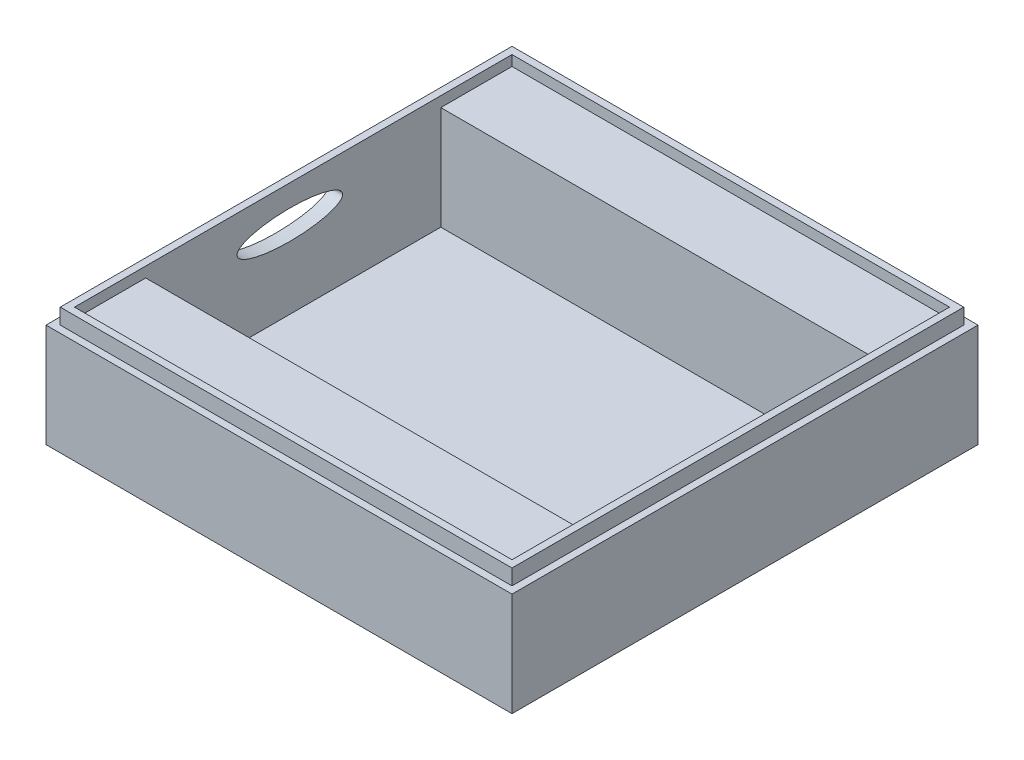
ISO-10303-21;
HEADER;
FILE_DESCRIPTION(('STEP AP214'),'2;1');
FILE_NAME('part.step','',(''),(''),'','','');
FILE_SCHEMA(('AUTOMOTIVE_DESIGN { 1 0 10303 214 1 1 1 1 }'));
ENDSEC;
DATA;
#1=APPLICATION_CONTEXT('core data for automotive mechanical design processes');
#2=APPLICATION_PROTOCOL_DEFINITION('international standard','automotive_design',2000,#1);
#3=PRODUCT_CONTEXT('',#1,'mechanical');
#4=PRODUCT('Part','Part','',(#3));
#5=PRODUCT_RELATED_PRODUCT_CATEGORY('part','',(#4));
#6=PRODUCT_DEFINITION_FORMATION('','',#4);
#7=PRODUCT_DEFINITION_CONTEXT('part definition',#1,'design');
#8=PRODUCT_DEFINITION('design','',#6,#7);
#9=PRODUCT_DEFINITION_SHAPE('','',#8);
#10=(LENGTH_UNIT() NAMED_UNIT(*) SI_UNIT(.MILLI.,.METRE.));
#11=(NAMED_UNIT(*) PLANE_ANGLE_UNIT() SI_UNIT($,.RADIAN.));
#12=(NAMED_UNIT(*) SI_UNIT($,.STERADIAN.) SOLID_ANGLE_UNIT());
#13=UNCERTAINTY_MEASURE_WITH_UNIT(LENGTH_MEASURE(1.E-05),#10,'distance_accuracy_value','');
#14=(GEOMETRIC_REPRESENTATION_CONTEXT(3) GLOBAL_UNCERTAINTY_ASSIGNED_CONTEXT((#13)) GLOBAL_UNIT_ASSIGNED_CONTEXT((#10,
#11,#12)) REPRESENTATION_CONTEXT('',''));
#15=CARTESIAN_POINT('',(0.,0.,0.));
#16=DIRECTION('',(0.,0.,1.));
#17=DIRECTION('',(1.,0.,0.));
#18=AXIS2_PLACEMENT_3D('',#15,#16,#17);
#19=CARTESIAN_POINT('',(0.,20.,0.));
#20=DIRECTION('',(0.,1.,0.));
#21=DIRECTION('',(0.,0.,1.));
#22=AXIS2_PLACEMENT_3D('',#19,#20,#21);
#23=PLANE('',#22);
#24=DIRECTION('',(0.,0.,1.));
#25=VECTOR('',#24,1.);
#26=CARTESIAN_POINT('',(-45.,20.,45.));
#27=LINE('',#26,#25);
#28=CARTESIAN_POINT('',(-45.,20.,-45.));
#29=VERTEX_POINT('',#28);
#30=CARTESIAN_POINT('',(-45.,20.,45.));
#31=VERTEX_POINT('',#30);
#32=EDGE_CURVE('E352',#29,#31,#27,.T.);
#33=ORIENTED_EDGE('',*,*,#32,.T.);
#34=DIRECTION('',(1.,0.,0.));
#35=VECTOR('',#34,1.);
#36=CARTESIAN_POINT('',(45.,20.,45.));
#37=LINE('',#36,#35);
#38=CARTESIAN_POINT('',(45.,20.,45.));
#39=VERTEX_POINT('',#38);
#40=EDGE_CURVE('E98',#31,#39,#37,.T.);
#41=ORIENTED_EDGE('',*,*,#40,.T.);
#42=DIRECTION('',(0.,0.,-1.));
#43=VECTOR('',#42,1.);
#44=CARTESIAN_POINT('',(45.,20.,45.));
#45=LINE('',#44,#43);
#46=CARTESIAN_POINT('',(45.,20.,-45.));
#47=VERTEX_POINT('',#46);
#48=EDGE_CURVE('E346',#39,#47,#45,.T.);
#49=ORIENTED_EDGE('',*,*,#48,.T.);
#50=DIRECTION('',(-1.,0.,0.));
#51=VECTOR('',#50,1.);
#52=CARTESIAN_POINT('',(45.,20.,-45.));
#53=LINE('',#52,#51);
#54=EDGE_CURVE('E70',#47,#29,#53,.T.);
#55=ORIENTED_EDGE('',*,*,#54,.T.);
#56=EDGE_LOOP('',(#33,#41,#49,#55));
#57=FACE_BOUND('',#56,.T.);
#58=DIRECTION('',(1.,0.,0.));
#59=VECTOR('',#58,1.);
#60=CARTESIAN_POINT('',(-43.625,20.,43.625));
#61=LINE('',#60,#59);
#62=CARTESIAN_POINT('',(-43.625,20.,43.625));
#63=VERTEX_POINT('',#62);
#64=CARTESIAN_POINT('',(43.625,20.,43.625));
#65=VERTEX_POINT('',#64);
#66=EDGE_CURVE('E232',#63,#65,#61,.T.);
#67=ORIENTED_EDGE('',*,*,#66,.F.);
#68=DIRECTION('',(0.,0.,1.));
#69=VECTOR('',#68,1.);
#70=CARTESIAN_POINT('',(-43.625,20.,-43.625));
#71=LINE('',#70,#69);
#72=CARTESIAN_POINT('',(-43.625,20.,-43.625));
#73=VERTEX_POINT('',#72);
#74=EDGE_CURVE('E191',#73,#63,#71,.T.);
#75=ORIENTED_EDGE('',*,*,#74,.F.);
#76=DIRECTION('',(-1.,0.,0.));
#77=VECTOR('',#76,1.);
#78=CARTESIAN_POINT('',(-43.625,20.,-43.625));
#79=LINE('',#78,#77);
#80=CARTESIAN_POINT('',(43.625,20.,-43.625));
#81=VERTEX_POINT('',#80);
#82=EDGE_CURVE('E219',#81,#73,#79,.T.);
#83=ORIENTED_EDGE('',*,*,#82,.F.);
#84=DIRECTION('',(0.,0.,-1.));
#85=VECTOR('',#84,1.);
#86=CARTESIAN_POINT('',(43.625,20.,-43.625));
#87=LINE('',#86,#85);
#88=EDGE_CURVE('E235',#65,#81,#87,.T.);
#89=ORIENTED_EDGE('',*,*,#88,.F.);
#90=EDGE_LOOP('',(#67,#75,#83,#89));
#91=FACE_BOUND('',#90,.T.);
#92=ADVANCED_FACE('F45',(#57,#91),#23,.T.);
#93=CARTESIAN_POINT('',(42.25,7.,42.25));
#94=DIRECTION('',(1.,0.,0.));
#95=DIRECTION('',(0.,0.,-1.));
#96=AXIS2_PLACEMENT_3D('',#93,#94,#95);
#97=PLANE('',#96);
#98=DIRECTION('',(0.,1.,0.));
#99=VECTOR('',#98,1.);
#100=CARTESIAN_POINT('',(42.25,1.,28.5));
#101=LINE('',#100,#99);
#102=CARTESIAN_POINT('',(42.25,1.,28.5));
#103=VERTEX_POINT('',#102);
#104=CARTESIAN_POINT('',(42.25,21.,28.5));
#105=VERTEX_POINT('',#104);
#106=EDGE_CURVE('E367',#103,#105,#101,.T.);
#107=ORIENTED_EDGE('',*,*,#106,.T.);
#108=DIRECTION('',(0.,0.,-1.));
#109=VECTOR('',#108,1.);
#110=CARTESIAN_POINT('',(42.25,21.,42.25));
#111=LINE('',#110,#109);
#112=CARTESIAN_POINT('',(42.25,21.,42.25));
#113=VERTEX_POINT('',#112);
#114=EDGE_CURVE('E261',#113,#105,#111,.T.);
#115=ORIENTED_EDGE('',*,*,#114,.F.);
#116=DIRECTION('',(0.,-1.,0.));
#117=VECTOR('',#116,1.);
#118=CARTESIAN_POINT('',(42.25,23.,42.25));
#119=LINE('',#118,#117);
#120=CARTESIAN_POINT('',(42.25,23.,42.25));
#121=VERTEX_POINT('',#120);
#122=EDGE_CURVE('E192',#121,#113,#119,.T.);
#123=ORIENTED_EDGE('',*,*,#122,.F.);
#124=DIRECTION('',(0.,0.,-1.));
#125=VECTOR('',#124,1.);
#126=CARTESIAN_POINT('',(42.25,23.,-42.25));
#127=LINE('',#126,#125);
#128=CARTESIAN_POINT('',(42.25,23.,-42.25));
#129=VERTEX_POINT('',#128);
#130=EDGE_CURVE('E197',#121,#129,#127,.T.);
#131=ORIENTED_EDGE('',*,*,#130,.T.);
#132=DIRECTION('',(0.,-1.,0.));
#133=VECTOR('',#132,1.);
#134=CARTESIAN_POINT('',(42.25,23.,-42.25));
#135=LINE('',#134,#133);
#136=CARTESIAN_POINT('',(42.25,21.,-42.25));
#137=VERTEX_POINT('',#136);
#138=EDGE_CURVE('E208',#129,#137,#135,.T.);
#139=ORIENTED_EDGE('',*,*,#138,.T.);
#140=DIRECTION('',(0.,0.,-1.));
#141=VECTOR('',#140,1.);
#142=CARTESIAN_POINT('',(42.25,21.,-42.25));
#143=LINE('',#142,#141);
#144=CARTESIAN_POINT('',(42.25,21.,-28.5));
#145=VERTEX_POINT('',#144);
#146=EDGE_CURVE('E273',#145,#137,#143,.T.);
#147=ORIENTED_EDGE('',*,*,#146,.F.);
#148=DIRECTION('',(0.,1.,0.));
#149=VECTOR('',#148,1.);
#150=CARTESIAN_POINT('',(42.25,1.,-28.5));
#151=LINE('',#150,#149);
#152=CARTESIAN_POINT('',(42.25,1.,-28.5));
#153=VERTEX_POINT('',#152);
#154=EDGE_CURVE('E383',#153,#145,#151,.T.);
#155=ORIENTED_EDGE('',*,*,#154,.F.);
#156=DIRECTION('',(0.,0.,-1.));
#157=VECTOR('',#156,1.);
#158=CARTESIAN_POINT('',(42.25,1.,28.5));
#159=LINE('',#158,#157);
#160=EDGE_CURVE('E287',#103,#153,#159,.T.);
#161=ORIENTED_EDGE('',*,*,#160,.F.);
#162=EDGE_LOOP('',(#107,#115,#123,#131,#139,#147,#155,#161));
#163=FACE_BOUND('',#162,.T.);
#164=ADVANCED_FACE('F312',(#163),#97,.F.);
#165=CARTESIAN_POINT('',(-42.25,7.,42.25));
#166=DIRECTION('',(-1.,0.,0.));
#167=DIRECTION('',(0.,0.,1.));
#168=AXIS2_PLACEMENT_3D('',#165,#166,#167);
#169=PLANE('',#168);
#170=CARTESIAN_POINT('',(-42.25,15.9834994570971,0.657720021009747));
#171=DIRECTION('',(-1.,0.,0.));
#172=DIRECTION('',(0.,0.,-1.));
#173=AXIS2_PLACEMENT_3D('',#170,#171,#172);
#174=ELLIPSE('',#173,10.196247105593,2.79357288826837);
#175=CARTESIAN_POINT('',(-42.25,15.9834994570971,-9.53852708458323));
#176=VERTEX_POINT('',#175);
#177=EDGE_CURVE('E282',#176,#176,#174,.T.);
#178=ORIENTED_EDGE('',*,*,#177,.T.);
#179=EDGE_LOOP('',(#178));
#180=FACE_BOUND('',#179,.T.);
#181=DIRECTION('',(0.,1.,0.));
#182=VECTOR('',#181,1.);
#183=CARTESIAN_POINT('',(-42.25,1.,-28.5));
#184=LINE('',#183,#182);
#185=CARTESIAN_POINT('',(-42.25,1.,-28.5));
#186=VERTEX_POINT('',#185);
#187=CARTESIAN_POINT('',(-42.25,21.,-28.5));
#188=VERTEX_POINT('',#187);
#189=EDGE_CURVE('E375',#186,#188,#184,.T.);
#190=ORIENTED_EDGE('',*,*,#189,.T.);
#191=DIRECTION('',(0.,0.,1.));
#192=VECTOR('',#191,1.);
#193=CARTESIAN_POINT('',(-42.25,21.,-42.25));
#194=LINE('',#193,#192);
#195=CARTESIAN_POINT('',(-42.25,21.,-42.25));
#196=VERTEX_POINT('',#195);
#197=EDGE_CURVE('E265',#196,#188,#194,.T.);
#198=ORIENTED_EDGE('',*,*,#197,.F.);
#199=DIRECTION('',(0.,-1.,0.));
#200=VECTOR('',#199,1.);
#201=CARTESIAN_POINT('',(-42.25,23.,-42.25));
#202=LINE('',#201,#200);
#203=CARTESIAN_POINT('',(-42.25,23.,-42.25));
#204=VERTEX_POINT('',#203);
#205=EDGE_CURVE('E177',#204,#196,#202,.T.);
#206=ORIENTED_EDGE('',*,*,#205,.F.);
#207=DIRECTION('',(0.,0.,1.));
#208=VECTOR('',#207,1.);
#209=CARTESIAN_POINT('',(-42.25,23.,-42.25));
#210=LINE('',#209,#208);
#211=CARTESIAN_POINT('',(-42.25,23.,42.25));
#212=VERTEX_POINT('',#211);
#213=EDGE_CURVE('E170',#204,#212,#210,.T.);
#214=ORIENTED_EDGE('',*,*,#213,.T.);
#215=DIRECTION('',(0.,-1.,0.));
#216=VECTOR('',#215,1.);
#217=CARTESIAN_POINT('',(-42.25,23.,42.25));
#218=LINE('',#217,#216);
#219=CARTESIAN_POINT('',(-42.25,21.,42.25));
#220=VERTEX_POINT('',#219);
#221=EDGE_CURVE('E174',#212,#220,#218,.T.);
#222=ORIENTED_EDGE('',*,*,#221,.T.);
#223=DIRECTION('',(0.,0.,1.));
#224=VECTOR('',#223,1.);
#225=CARTESIAN_POINT('',(-42.25,21.,42.25));
#226=LINE('',#225,#224);
#227=CARTESIAN_POINT('',(-42.25,21.,28.5));
#228=VERTEX_POINT('',#227);
#229=EDGE_CURVE('E254',#228,#220,#226,.T.);
#230=ORIENTED_EDGE('',*,*,#229,.F.);
#231=DIRECTION('',(0.,1.,0.));
#232=VECTOR('',#231,1.);
#233=CARTESIAN_POINT('',(-42.25,1.,28.5));
#234=LINE('',#233,#232);
#235=CARTESIAN_POINT('',(-42.25,1.,28.5));
#236=VERTEX_POINT('',#235);
#237=EDGE_CURVE('E370',#236,#228,#234,.T.);
#238=ORIENTED_EDGE('',*,*,#237,.F.);
#239=DIRECTION('',(0.,0.,1.));
#240=VECTOR('',#239,1.);
#241=CARTESIAN_POINT('',(-42.25,1.,28.5));
#242=LINE('',#241,#240);
#243=EDGE_CURVE('E439',#186,#236,#242,.T.);
#244=ORIENTED_EDGE('',*,*,#243,.F.);
#245=EDGE_LOOP('',(#190,#198,#206,#214,#222,#230,#238,#244));
#246=FACE_BOUND('',#245,.T.);
#247=ADVANCED_FACE('F172',(#180,#246),#169,.F.);
#248=CARTESIAN_POINT('',(-45.,20.,45.));
#249=DIRECTION('',(1.,0.,0.));
#250=DIRECTION('',(0.,0.,-1.));
#251=AXIS2_PLACEMENT_3D('',#248,#249,#250);
#252=PLANE('',#251);
#253=CARTESIAN_POINT('',(-45.,15.9834994570971,0.657720021009747));
#254=DIRECTION('',(-1.,0.,0.));
#255=DIRECTION('',(0.,0.,-1.));
#256=AXIS2_PLACEMENT_3D('',#253,#254,#255);
#257=ELLIPSE('',#256,10.196247105593,2.79357288826837);
#258=CARTESIAN_POINT('',(-45.,15.9834994570971,-9.53852708458323));
#259=VERTEX_POINT('',#258);
#260=EDGE_CURVE('E281',#259,#259,#257,.T.);
#261=ORIENTED_EDGE('',*,*,#260,.F.);
#262=EDGE_LOOP('',(#261));
#263=FACE_BOUND('',#262,.T.);
#264=DIRECTION('',(0.,0.,1.));
#265=VECTOR('',#264,1.);
#266=CARTESIAN_POINT('',(-45.,0.,45.));
#267=LINE('',#266,#265);
#268=CARTESIAN_POINT('',(-45.,0.,-45.));
#269=VERTEX_POINT('',#268);
#270=CARTESIAN_POINT('',(-45.,0.,45.));
#271=VERTEX_POINT('',#270);
#272=EDGE_CURVE('E343',#269,#271,#267,.T.);
#273=ORIENTED_EDGE('',*,*,#272,.T.);
#274=DIRECTION('',(0.,-1.,0.));
#275=VECTOR('',#274,1.);
#276=CARTESIAN_POINT('',(-45.,20.,45.));
#277=LINE('',#276,#275);
#278=EDGE_CURVE('E11',#31,#271,#277,.T.);
#279=ORIENTED_EDGE('',*,*,#278,.F.);
#280=ORIENTED_EDGE('',*,*,#32,.F.);
#281=DIRECTION('',(0.,-1.,0.));
#282=VECTOR('',#281,1.);
#283=CARTESIAN_POINT('',(-45.,20.,-45.));
#284=LINE('',#283,#282);
#285=EDGE_CURVE('E356',#29,#269,#284,.T.);
#286=ORIENTED_EDGE('',*,*,#285,.T.);
#287=EDGE_LOOP('',(#273,#279,#280,#286));
#288=FACE_BOUND('',#287,.T.);
#289=ADVANCED_FACE('F47',(#263,#288),#252,.F.);
#290=CARTESIAN_POINT('',(45.,20.,45.));
#291=DIRECTION('',(0.,0.,-1.));
#292=DIRECTION('',(-1.,0.,0.));
#293=AXIS2_PLACEMENT_3D('',#290,#291,#292);
#294=PLANE('',#293);
#295=DIRECTION('',(1.,0.,0.));
#296=VECTOR('',#295,1.);
#297=CARTESIAN_POINT('',(45.,0.,45.));
#298=LINE('',#297,#296);
#299=CARTESIAN_POINT('',(45.,0.,45.));
#300=VERTEX_POINT('',#299);
#301=EDGE_CURVE('E334',#271,#300,#298,.T.);
#302=ORIENTED_EDGE('',*,*,#301,.T.);
#303=DIRECTION('',(0.,-1.,0.));
#304=VECTOR('',#303,1.);
#305=CARTESIAN_POINT('',(45.,20.,45.));
#306=LINE('',#305,#304);
#307=EDGE_CURVE('E54',#39,#300,#306,.T.);
#308=ORIENTED_EDGE('',*,*,#307,.F.);
#309=ORIENTED_EDGE('',*,*,#40,.F.);
#310=ORIENTED_EDGE('',*,*,#278,.T.);
#311=EDGE_LOOP('',(#302,#308,#309,#310));
#312=FACE_BOUND('',#311,.T.);
#313=ADVANCED_FACE('F327',(#312),#294,.F.);
#314=CARTESIAN_POINT('',(45.,20.,45.));
#315=DIRECTION('',(-1.,0.,0.));
#316=DIRECTION('',(0.,0.,1.));
#317=AXIS2_PLACEMENT_3D('',#314,#315,#316);
#318=PLANE('',#317);
#319=DIRECTION('',(0.,0.,-1.));
#320=VECTOR('',#319,1.);
#321=CARTESIAN_POINT('',(45.,0.,45.));
#322=LINE('',#321,#320);
#323=CARTESIAN_POINT('',(45.,0.,-45.));
#324=VERTEX_POINT('',#323);
#325=EDGE_CURVE('E342',#300,#324,#322,.T.);
#326=ORIENTED_EDGE('',*,*,#325,.T.);
#327=DIRECTION('',(0.,-1.,0.));
#328=VECTOR('',#327,1.);
#329=CARTESIAN_POINT('',(45.,20.,-45.));
#330=LINE('',#329,#328);
#331=EDGE_CURVE('E348',#47,#324,#330,.T.);
#332=ORIENTED_EDGE('',*,*,#331,.F.);
#333=ORIENTED_EDGE('',*,*,#48,.F.);
#334=ORIENTED_EDGE('',*,*,#307,.T.);
#335=EDGE_LOOP('',(#326,#332,#333,#334));
#336=FACE_BOUND('',#335,.T.);
#337=ADVANCED_FACE('F325',(#336),#318,.F.);
#338=CARTESIAN_POINT('',(45.,20.,-45.));
#339=DIRECTION('',(0.,0.,1.));
#340=DIRECTION('',(1.,0.,0.));
#341=AXIS2_PLACEMENT_3D('',#338,#339,#340);
#342=PLANE('',#341);
#343=DIRECTION('',(-1.,0.,0.));
#344=VECTOR('',#343,1.);
#345=CARTESIAN_POINT('',(45.,0.,-45.));
#346=LINE('',#345,#344);
#347=EDGE_CURVE('E91',#324,#269,#346,.T.);
#348=ORIENTED_EDGE('',*,*,#347,.T.);
#349=ORIENTED_EDGE('',*,*,#285,.F.);
#350=ORIENTED_EDGE('',*,*,#54,.F.);
#351=ORIENTED_EDGE('',*,*,#331,.T.);
#352=EDGE_LOOP('',(#348,#349,#350,#351));
#353=FACE_BOUND('',#352,.T.);
#354=ADVANCED_FACE('F321',(#353),#342,.F.);
#355=CARTESIAN_POINT('',(0.,0.,0.));
#356=DIRECTION('',(0.,1.,0.));
#357=DIRECTION('',(0.,0.,1.));
#358=AXIS2_PLACEMENT_3D('',#355,#356,#357);
#359=PLANE('',#358);
#360=ORIENTED_EDGE('',*,*,#272,.F.);
#361=ORIENTED_EDGE('',*,*,#347,.F.);
#362=ORIENTED_EDGE('',*,*,#325,.F.);
#363=ORIENTED_EDGE('',*,*,#301,.F.);
#364=EDGE_LOOP('',(#360,#361,#362,#363));
#365=FACE_BOUND('',#364,.T.);
#366=ADVANCED_FACE('F305',(#365),#359,.F.);
#367=CARTESIAN_POINT('',(-42.25,1.,28.5));
#368=DIRECTION('',(0.,0.,1.));
#369=DIRECTION('',(1.,0.,0.));
#370=AXIS2_PLACEMENT_3D('',#367,#368,#369);
#371=PLANE('',#370);
#372=ORIENTED_EDGE('',*,*,#237,.T.);
#373=DIRECTION('',(-1.,0.,0.));
#374=VECTOR('',#373,1.);
#375=CARTESIAN_POINT('',(42.25,21.,28.5));
#376=LINE('',#375,#374);
#377=EDGE_CURVE('E257',#105,#228,#376,.T.);
#378=ORIENTED_EDGE('',*,*,#377,.F.);
#379=ORIENTED_EDGE('',*,*,#106,.F.);
#380=DIRECTION('',(1.,0.,0.));
#381=VECTOR('',#380,1.);
#382=CARTESIAN_POINT('',(-42.25,1.,28.5));
#383=LINE('',#382,#381);
#384=EDGE_CURVE('E378',#236,#103,#383,.T.);
#385=ORIENTED_EDGE('',*,*,#384,.F.);
#386=EDGE_LOOP('',(#372,#378,#379,#385));
#387=FACE_BOUND('',#386,.T.);
#388=ADVANCED_FACE('F302',(#387),#371,.F.);
#389=CARTESIAN_POINT('',(-42.25,1.,-28.5));
#390=DIRECTION('',(0.,0.,-1.));
#391=DIRECTION('',(-1.,0.,0.));
#392=AXIS2_PLACEMENT_3D('',#389,#390,#391);
#393=PLANE('',#392);
#394=ORIENTED_EDGE('',*,*,#154,.T.);
#395=DIRECTION('',(1.,0.,0.));
#396=VECTOR('',#395,1.);
#397=CARTESIAN_POINT('',(-42.25,21.,-28.5));
#398=LINE('',#397,#396);
#399=EDGE_CURVE('E269',#188,#145,#398,.T.);
#400=ORIENTED_EDGE('',*,*,#399,.F.);
#401=ORIENTED_EDGE('',*,*,#189,.F.);
#402=DIRECTION('',(-1.,0.,0.));
#403=VECTOR('',#402,1.);
#404=CARTESIAN_POINT('',(-42.25,1.,-28.5));
#405=LINE('',#404,#403);
#406=EDGE_CURVE('E435',#153,#186,#405,.T.);
#407=ORIENTED_EDGE('',*,*,#406,.F.);
#408=EDGE_LOOP('',(#394,#400,#401,#407));
#409=FACE_BOUND('',#408,.T.);
#410=ADVANCED_FACE('F300',(#409),#393,.F.);
#411=CARTESIAN_POINT('',(0.,1.,0.));
#412=DIRECTION('',(0.,-1.,0.));
#413=DIRECTION('',(0.,0.,-1.));
#414=AXIS2_PLACEMENT_3D('',#411,#412,#413);
#415=PLANE('',#414);
#416=ORIENTED_EDGE('',*,*,#160,.T.);
#417=ORIENTED_EDGE('',*,*,#406,.T.);
#418=ORIENTED_EDGE('',*,*,#243,.T.);
#419=ORIENTED_EDGE('',*,*,#384,.T.);
#420=EDGE_LOOP('',(#416,#417,#418,#419));
#421=FACE_BOUND('',#420,.T.);
#422=ADVANCED_FACE('F295',(#421),#415,.F.);
#423=DIRECTION('',(-1.,0.,0.));
#424=VECTOR('',#423,1.);
#425=SURFACE_OF_LINEAR_EXTRUSION('',#174,#424);
#426=ORIENTED_EDGE('',*,*,#177,.F.);
#427=EDGE_LOOP('',(#426));
#428=FACE_BOUND('',#427,.T.);
#429=ORIENTED_EDGE('',*,*,#260,.T.);
#430=EDGE_LOOP('',(#429));
#431=FACE_BOUND('',#430,.T.);
#432=ADVANCED_FACE('F290',(#428,#431),#425,.F.);
#433=CARTESIAN_POINT('',(0.,21.,0.));
#434=DIRECTION('',(0.,1.,0.));
#435=DIRECTION('',(0.,0.,1.));
#436=AXIS2_PLACEMENT_3D('',#433,#434,#435);
#437=PLANE('',#436);
#438=ORIENTED_EDGE('',*,*,#197,.T.);
#439=ORIENTED_EDGE('',*,*,#399,.T.);
#440=ORIENTED_EDGE('',*,*,#146,.T.);
#441=DIRECTION('',(-1.,0.,0.));
#442=VECTOR('',#441,1.);
#443=CARTESIAN_POINT('',(-42.25,21.,-42.25));
#444=LINE('',#443,#442);
#445=EDGE_CURVE('E277',#137,#196,#444,.T.);
#446=ORIENTED_EDGE('',*,*,#445,.T.);
#447=EDGE_LOOP('',(#438,#439,#440,#446));
#448=FACE_BOUND('',#447,.T.);
#449=ADVANCED_FACE('F294',(#448),#437,.T.);
#450=CARTESIAN_POINT('',(0.,21.,0.));
#451=DIRECTION('',(0.,1.,0.));
#452=DIRECTION('',(0.,0.,1.));
#453=AXIS2_PLACEMENT_3D('',#450,#451,#452);
#454=PLANE('',#453);
#455=ORIENTED_EDGE('',*,*,#114,.T.);
#456=ORIENTED_EDGE('',*,*,#377,.T.);
#457=ORIENTED_EDGE('',*,*,#229,.T.);
#458=DIRECTION('',(1.,0.,0.));
#459=VECTOR('',#458,1.);
#460=CARTESIAN_POINT('',(42.25,21.,42.25));
#461=LINE('',#460,#459);
#462=EDGE_CURVE('E189',#220,#113,#461,.T.);
#463=ORIENTED_EDGE('',*,*,#462,.T.);
#464=EDGE_LOOP('',(#455,#456,#457,#463));
#465=FACE_BOUND('',#464,.T.);
#466=ADVANCED_FACE('F420',(#465),#454,.T.);
#467=CARTESIAN_POINT('',(0.,23.,0.));
#468=DIRECTION('',(0.,1.,0.));
#469=DIRECTION('',(0.,0.,1.));
#470=AXIS2_PLACEMENT_3D('',#467,#468,#469);
#471=PLANE('',#470);
#472=DIRECTION('',(0.,0.,1.));
#473=VECTOR('',#472,1.);
#474=CARTESIAN_POINT('',(-43.625,23.,-43.625));
#475=LINE('',#474,#473);
#476=CARTESIAN_POINT('',(-43.625,23.,-43.625));
#477=VERTEX_POINT('',#476);
#478=CARTESIAN_POINT('',(-43.625,23.,43.625));
#479=VERTEX_POINT('',#478);
#480=EDGE_CURVE('E214',#477,#479,#475,.T.);
#481=ORIENTED_EDGE('',*,*,#480,.T.);
#482=DIRECTION('',(1.,0.,0.));
#483=VECTOR('',#482,1.);
#484=CARTESIAN_POINT('',(-43.625,23.,43.625));
#485=LINE('',#484,#483);
#486=CARTESIAN_POINT('',(43.625,23.,43.625));
#487=VERTEX_POINT('',#486);
#488=EDGE_CURVE('E218',#479,#487,#485,.T.);
#489=ORIENTED_EDGE('',*,*,#488,.T.);
#490=DIRECTION('',(0.,0.,-1.));
#491=VECTOR('',#490,1.);
#492=CARTESIAN_POINT('',(43.625,23.,-43.625));
#493=LINE('',#492,#491);
#494=CARTESIAN_POINT('',(43.625,23.,-43.625));
#495=VERTEX_POINT('',#494);
#496=EDGE_CURVE('E222',#487,#495,#493,.T.);
#497=ORIENTED_EDGE('',*,*,#496,.T.);
#498=DIRECTION('',(-1.,0.,0.));
#499=VECTOR('',#498,1.);
#500=CARTESIAN_POINT('',(-43.625,23.,-43.625));
#501=LINE('',#500,#499);
#502=EDGE_CURVE('E225',#495,#477,#501,.T.);
#503=ORIENTED_EDGE('',*,*,#502,.T.);
#504=EDGE_LOOP('',(#481,#489,#497,#503));
#505=FACE_BOUND('',#504,.T.);
#506=DIRECTION('',(1.,0.,0.));
#507=VECTOR('',#506,1.);
#508=CARTESIAN_POINT('',(-42.25,23.,42.25));
#509=LINE('',#508,#507);
#510=EDGE_CURVE('E182',#212,#121,#509,.T.);
#511=ORIENTED_EDGE('',*,*,#510,.F.);
#512=ORIENTED_EDGE('',*,*,#213,.F.);
#513=DIRECTION('',(-1.,0.,0.));
#514=VECTOR('',#513,1.);
#515=CARTESIAN_POINT('',(-42.25,23.,-42.25));
#516=LINE('',#515,#514);
#517=EDGE_CURVE('E201',#129,#204,#516,.T.);
#518=ORIENTED_EDGE('',*,*,#517,.F.);
#519=ORIENTED_EDGE('',*,*,#130,.F.);
#520=EDGE_LOOP('',(#511,#512,#518,#519));
#521=FACE_BOUND('',#520,.T.);
#522=ADVANCED_FACE('F195',(#505,#521),#471,.T.);
#523=CARTESIAN_POINT('',(-43.625,23.,-43.625));
#524=DIRECTION('',(1.,0.,0.));
#525=DIRECTION('',(0.,0.,-1.));
#526=AXIS2_PLACEMENT_3D('',#523,#524,#525);
#527=PLANE('',#526);
#528=ORIENTED_EDGE('',*,*,#74,.T.);
#529=DIRECTION('',(0.,-1.,0.));
#530=VECTOR('',#529,1.);
#531=CARTESIAN_POINT('',(-43.625,23.,43.625));
#532=LINE('',#531,#530);
#533=EDGE_CURVE('E249',#479,#63,#532,.T.);
#534=ORIENTED_EDGE('',*,*,#533,.F.);
#535=ORIENTED_EDGE('',*,*,#480,.F.);
#536=DIRECTION('',(0.,-1.,0.));
#537=VECTOR('',#536,1.);
#538=CARTESIAN_POINT('',(-43.625,23.,-43.625));
#539=LINE('',#538,#537);
#540=EDGE_CURVE('E228',#477,#73,#539,.T.);
#541=ORIENTED_EDGE('',*,*,#540,.T.);
#542=EDGE_LOOP('',(#528,#534,#535,#541));
#543=FACE_BOUND('',#542,.T.);
#544=ADVANCED_FACE('F404',(#543),#527,.F.);
#545=CARTESIAN_POINT('',(-43.625,23.,43.625));
#546=DIRECTION('',(0.,0.,-1.));
#547=DIRECTION('',(-1.,0.,0.));
#548=AXIS2_PLACEMENT_3D('',#545,#546,#547);
#549=PLANE('',#548);
#550=ORIENTED_EDGE('',*,*,#66,.T.);
#551=DIRECTION('',(0.,-1.,0.));
#552=VECTOR('',#551,1.);
#553=CARTESIAN_POINT('',(43.625,23.,43.625));
#554=LINE('',#553,#552);
#555=EDGE_CURVE('E245',#487,#65,#554,.T.);
#556=ORIENTED_EDGE('',*,*,#555,.F.);
#557=ORIENTED_EDGE('',*,*,#488,.F.);
#558=ORIENTED_EDGE('',*,*,#533,.T.);
#559=EDGE_LOOP('',(#550,#556,#557,#558));
#560=FACE_BOUND('',#559,.T.);
#561=ADVANCED_FACE('F395',(#560),#549,.F.);
#562=CARTESIAN_POINT('',(43.625,23.,-43.625));
#563=DIRECTION('',(-1.,0.,0.));
#564=DIRECTION('',(0.,0.,1.));
#565=AXIS2_PLACEMENT_3D('',#562,#563,#564);
#566=PLANE('',#565);
#567=ORIENTED_EDGE('',*,*,#88,.T.);
#568=DIRECTION('',(0.,-1.,0.));
#569=VECTOR('',#568,1.);
#570=CARTESIAN_POINT('',(43.625,23.,-43.625));
#571=LINE('',#570,#569);
#572=EDGE_CURVE('E61',#495,#81,#571,.T.);
#573=ORIENTED_EDGE('',*,*,#572,.F.);
#574=ORIENTED_EDGE('',*,*,#496,.F.);
#575=ORIENTED_EDGE('',*,*,#555,.T.);
#576=EDGE_LOOP('',(#567,#573,#574,#575));
#577=FACE_BOUND('',#576,.T.);
#578=ADVANCED_FACE('F399',(#577),#566,.F.);
#579=CARTESIAN_POINT('',(-43.625,23.,-43.625));
#580=DIRECTION('',(0.,0.,1.));
#581=DIRECTION('',(1.,0.,0.));
#582=AXIS2_PLACEMENT_3D('',#579,#580,#581);
#583=PLANE('',#582);
#584=ORIENTED_EDGE('',*,*,#82,.T.);
#585=ORIENTED_EDGE('',*,*,#540,.F.);
#586=ORIENTED_EDGE('',*,*,#502,.F.);
#587=ORIENTED_EDGE('',*,*,#572,.T.);
#588=EDGE_LOOP('',(#584,#585,#586,#587));
#589=FACE_BOUND('',#588,.T.);
#590=ADVANCED_FACE('F405',(#589),#583,.F.);
#591=CARTESIAN_POINT('',(-42.25,23.,42.25));
#592=DIRECTION('',(0.,0.,-1.));
#593=DIRECTION('',(-1.,0.,0.));
#594=AXIS2_PLACEMENT_3D('',#591,#592,#593);
#595=PLANE('',#594);
#596=ORIENTED_EDGE('',*,*,#122,.T.);
#597=ORIENTED_EDGE('',*,*,#462,.F.);
#598=ORIENTED_EDGE('',*,*,#221,.F.);
#599=ORIENTED_EDGE('',*,*,#510,.T.);
#600=EDGE_LOOP('',(#596,#597,#598,#599));
#601=FACE_BOUND('',#600,.T.);
#602=ADVANCED_FACE('F186',(#601),#595,.T.);
#603=CARTESIAN_POINT('',(-42.25,23.,-42.25));
#604=DIRECTION('',(0.,0.,1.));
#605=DIRECTION('',(1.,0.,0.));
#606=AXIS2_PLACEMENT_3D('',#603,#604,#605);
#607=PLANE('',#606);
#608=ORIENTED_EDGE('',*,*,#205,.T.);
#609=ORIENTED_EDGE('',*,*,#445,.F.);
#610=ORIENTED_EDGE('',*,*,#138,.F.);
#611=ORIENTED_EDGE('',*,*,#517,.T.);
#612=EDGE_LOOP('',(#608,#609,#610,#611));
#613=FACE_BOUND('',#612,.T.);
#614=ADVANCED_FACE('F412',(#613),#607,.T.);
#615=CLOSED_SHELL('',(#92,#164,#247,#289,#313,#337,#354,#366,#388,#410,#422,#432,#449,#466,#522,
#544,#561,#578,#590,#602,#614));
#616=MANIFOLD_SOLID_BREP('B2',#615);
#617=ADVANCED_BREP_SHAPE_REPRESENTATION('',(#18,#616),#14);
#618=SHAPE_DEFINITION_REPRESENTATION(#9,#617);
ENDSEC;
END-ISO-10303-21;
